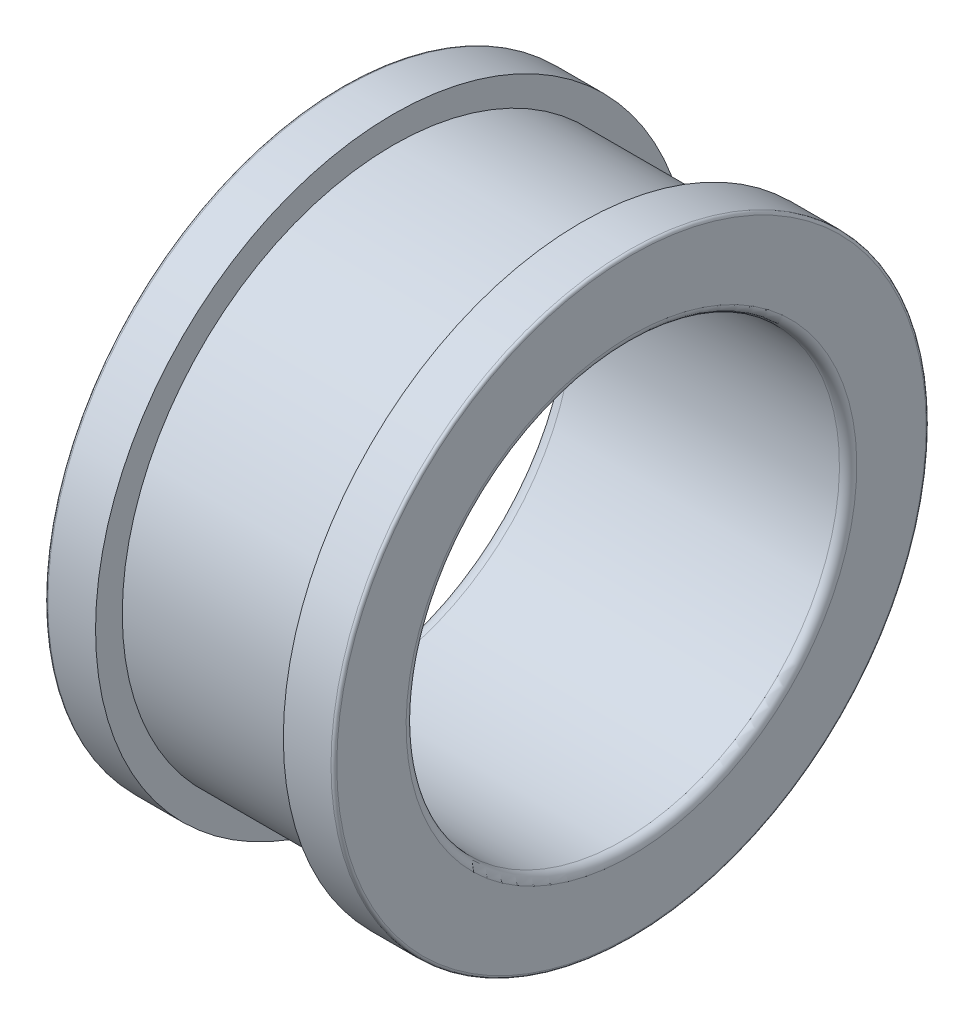
ISO-10303-21;
HEADER;
FILE_DESCRIPTION(('STEP AP214'),'2;1');
FILE_NAME('part.step','',(''),(''),'','','');
FILE_SCHEMA(('AUTOMOTIVE_DESIGN { 1 0 10303 214 1 1 1 1 }'));
ENDSEC;
DATA;
#1=APPLICATION_CONTEXT('core data for automotive mechanical design processes');
#2=APPLICATION_PROTOCOL_DEFINITION('international standard','automotive_design',2000,#1);
#3=PRODUCT_CONTEXT('',#1,'mechanical');
#4=PRODUCT('Part','Part','',(#3));
#5=PRODUCT_RELATED_PRODUCT_CATEGORY('part','',(#4));
#6=PRODUCT_DEFINITION_FORMATION('','',#4);
#7=PRODUCT_DEFINITION_CONTEXT('part definition',#1,'design');
#8=PRODUCT_DEFINITION('design','',#6,#7);
#9=PRODUCT_DEFINITION_SHAPE('','',#8);
#10=(LENGTH_UNIT() NAMED_UNIT(*) SI_UNIT(.MILLI.,.METRE.));
#11=(NAMED_UNIT(*) PLANE_ANGLE_UNIT() SI_UNIT($,.RADIAN.));
#12=(NAMED_UNIT(*) SI_UNIT($,.STERADIAN.) SOLID_ANGLE_UNIT());
#13=UNCERTAINTY_MEASURE_WITH_UNIT(LENGTH_MEASURE(1.E-05),#10,'distance_accuracy_value','');
#14=(GEOMETRIC_REPRESENTATION_CONTEXT(3) GLOBAL_UNCERTAINTY_ASSIGNED_CONTEXT((#13)) GLOBAL_UNIT_ASSIGNED_CONTEXT((#10,
#11,#12)) REPRESENTATION_CONTEXT('',''));
#15=CARTESIAN_POINT('',(0.,0.,0.));
#16=DIRECTION('',(0.,0.,1.));
#17=DIRECTION('',(1.,0.,0.));
#18=AXIS2_PLACEMENT_3D('',#15,#16,#17);
#19=CARTESIAN_POINT('',(18.15,0.,0.));
#20=DIRECTION('',(-1.,0.,0.));
#21=DIRECTION('',(0.,1.,0.));
#22=AXIS2_PLACEMENT_3D('',#19,#20,#21);
#23=CYLINDRICAL_SURFACE('',#22,20.6);
#24=CARTESIAN_POINT('',(16.5,0.,0.));
#25=DIRECTION('',(1.,0.,0.));
#26=DIRECTION('',(0.,1.,0.));
#27=AXIS2_PLACEMENT_3D('',#24,#25,#26);
#28=CIRCLE('',#27,20.6);
#29=CARTESIAN_POINT('',(16.5,20.6,0.));
#30=VERTEX_POINT('',#29);
#31=EDGE_CURVE('E11',#30,#30,#28,.T.);
#32=ORIENTED_EDGE('',*,*,#31,.T.);
#33=EDGE_LOOP('',(#32));
#34=FACE_BOUND('',#33,.T.);
#35=CARTESIAN_POINT('',(19.8,0.,0.));
#36=DIRECTION('',(1.,0.,0.));
#37=DIRECTION('',(0.,1.,0.));
#38=AXIS2_PLACEMENT_3D('',#35,#36,#37);
#39=CIRCLE('',#38,20.6);
#40=CARTESIAN_POINT('',(19.8,20.6,0.));
#41=VERTEX_POINT('',#40);
#42=EDGE_CURVE('E82',#41,#41,#39,.T.);
#43=ORIENTED_EDGE('',*,*,#42,.F.);
#44=EDGE_LOOP('',(#43));
#45=FACE_BOUND('',#44,.T.);
#46=ADVANCED_FACE('F17',(#34,#45),#23,.T.);
#47=CARTESIAN_POINT('',(16.5,19.675,0.));
#48=DIRECTION('',(-1.,0.,0.));
#49=DIRECTION('',(0.,-1.,0.));
#50=AXIS2_PLACEMENT_3D('',#47,#48,#49);
#51=PLANE('',#50);
#52=CARTESIAN_POINT('',(16.5,0.,0.));
#53=DIRECTION('',(1.,0.,0.));
#54=DIRECTION('',(0.,1.,0.));
#55=AXIS2_PLACEMENT_3D('',#52,#53,#54);
#56=CIRCLE('',#55,18.75);
#57=CARTESIAN_POINT('',(16.5,18.75,0.));
#58=VERTEX_POINT('',#57);
#59=EDGE_CURVE('E25',#58,#58,#56,.T.);
#60=ORIENTED_EDGE('',*,*,#59,.T.);
#61=EDGE_LOOP('',(#60));
#62=FACE_BOUND('',#61,.T.);
#63=ORIENTED_EDGE('',*,*,#31,.F.);
#64=EDGE_LOOP('',(#63));
#65=FACE_BOUND('',#64,.T.);
#66=ADVANCED_FACE('F109',(#62,#65),#51,.T.);
#67=CARTESIAN_POINT('',(10.,0.,0.));
#68=DIRECTION('',(-1.,0.,0.));
#69=DIRECTION('',(0.,1.,0.));
#70=AXIS2_PLACEMENT_3D('',#67,#68,#69);
#71=CYLINDRICAL_SURFACE('',#70,18.75);
#72=CARTESIAN_POINT('',(3.5,0.,0.));
#73=DIRECTION('',(1.,0.,0.));
#74=DIRECTION('',(0.,1.,0.));
#75=AXIS2_PLACEMENT_3D('',#72,#73,#74);
#76=CIRCLE('',#75,18.75);
#77=CARTESIAN_POINT('',(3.5,18.75,0.));
#78=VERTEX_POINT('',#77);
#79=EDGE_CURVE('E77',#78,#78,#76,.T.);
#80=ORIENTED_EDGE('',*,*,#79,.T.);
#81=EDGE_LOOP('',(#80));
#82=FACE_BOUND('',#81,.T.);
#83=ORIENTED_EDGE('',*,*,#59,.F.);
#84=EDGE_LOOP('',(#83));
#85=FACE_BOUND('',#84,.T.);
#86=ADVANCED_FACE('F113',(#82,#85),#71,.T.);
#87=CARTESIAN_POINT('',(3.5,19.675,0.));
#88=DIRECTION('',(1.,0.,0.));
#89=DIRECTION('',(0.,1.,0.));
#90=AXIS2_PLACEMENT_3D('',#87,#88,#89);
#91=PLANE('',#90);
#92=CARTESIAN_POINT('',(3.5,0.,0.));
#93=DIRECTION('',(1.,0.,0.));
#94=DIRECTION('',(0.,1.,0.));
#95=AXIS2_PLACEMENT_3D('',#92,#93,#94);
#96=CIRCLE('',#95,20.6);
#97=CARTESIAN_POINT('',(3.5,20.6,0.));
#98=VERTEX_POINT('',#97);
#99=EDGE_CURVE('E71',#98,#98,#96,.T.);
#100=ORIENTED_EDGE('',*,*,#99,.T.);
#101=EDGE_LOOP('',(#100));
#102=FACE_BOUND('',#101,.T.);
#103=ORIENTED_EDGE('',*,*,#79,.F.);
#104=EDGE_LOOP('',(#103));
#105=FACE_BOUND('',#104,.T.);
#106=ADVANCED_FACE('F141',(#102,#105),#91,.T.);
#107=CARTESIAN_POINT('',(1.85,0.,0.));
#108=DIRECTION('',(-1.,0.,0.));
#109=DIRECTION('',(0.,1.,0.));
#110=AXIS2_PLACEMENT_3D('',#107,#108,#109);
#111=CYLINDRICAL_SURFACE('',#110,20.6);
#112=CARTESIAN_POINT('',(0.2,0.,0.));
#113=DIRECTION('',(1.,0.,0.));
#114=DIRECTION('',(0.,1.,0.));
#115=AXIS2_PLACEMENT_3D('',#112,#113,#114);
#116=CIRCLE('',#115,20.6);
#117=CARTESIAN_POINT('',(0.2,20.6,0.));
#118=VERTEX_POINT('',#117);
#119=EDGE_CURVE('E69',#118,#118,#116,.T.);
#120=ORIENTED_EDGE('',*,*,#119,.T.);
#121=EDGE_LOOP('',(#120));
#122=FACE_BOUND('',#121,.T.);
#123=ORIENTED_EDGE('',*,*,#99,.F.);
#124=EDGE_LOOP('',(#123));
#125=FACE_BOUND('',#124,.T.);
#126=ADVANCED_FACE('F135',(#122,#125),#111,.T.);
#127=CARTESIAN_POINT('',(0.2,0.,0.));
#128=DIRECTION('',(1.,0.,0.));
#129=DIRECTION('',(0.,0.,-1.));
#130=AXIS2_PLACEMENT_3D('',#127,#128,#129);
#131=TOROIDAL_SURFACE('',#130,20.4,0.2);
#132=CARTESIAN_POINT('',(0.,0.,0.));
#133=DIRECTION('',(1.,0.,0.));
#134=DIRECTION('',(0.,1.,0.));
#135=AXIS2_PLACEMENT_3D('',#132,#133,#134);
#136=CIRCLE('',#135,20.4);
#137=CARTESIAN_POINT('',(0.,20.4,0.));
#138=VERTEX_POINT('',#137);
#139=EDGE_CURVE('E65',#138,#138,#136,.T.);
#140=ORIENTED_EDGE('',*,*,#139,.T.);
#141=EDGE_LOOP('',(#140));
#142=FACE_BOUND('',#141,.T.);
#143=ORIENTED_EDGE('',*,*,#119,.F.);
#144=EDGE_LOOP('',(#143));
#145=FACE_BOUND('',#144,.T.);
#146=ADVANCED_FACE('F66',(#142,#145),#131,.T.);
#147=CARTESIAN_POINT('',(0.,18.2,0.));
#148=DIRECTION('',(-1.,0.,0.));
#149=DIRECTION('',(0.,-1.,0.));
#150=AXIS2_PLACEMENT_3D('',#147,#148,#149);
#151=PLANE('',#150);
#152=CARTESIAN_POINT('',(0.,0.,0.));
#153=DIRECTION('',(1.,0.,0.));
#154=DIRECTION('',(0.,1.,0.));
#155=AXIS2_PLACEMENT_3D('',#152,#153,#154);
#156=CIRCLE('',#155,16.);
#157=CARTESIAN_POINT('',(0.,16.,0.));
#158=VERTEX_POINT('',#157);
#159=EDGE_CURVE('E70',#158,#158,#156,.T.);
#160=ORIENTED_EDGE('',*,*,#159,.T.);
#161=EDGE_LOOP('',(#160));
#162=FACE_BOUND('',#161,.T.);
#163=ORIENTED_EDGE('',*,*,#139,.F.);
#164=EDGE_LOOP('',(#163));
#165=FACE_BOUND('',#164,.T.);
#166=ADVANCED_FACE('F127',(#162,#165),#151,.T.);
#167=CARTESIAN_POINT('',(1.,0.,0.));
#168=DIRECTION('',(1.,0.,0.));
#169=DIRECTION('',(0.,0.,-1.));
#170=AXIS2_PLACEMENT_3D('',#167,#168,#169);
#171=TOROIDAL_SURFACE('',#170,16.,1.);
#172=CARTESIAN_POINT('',(1.,0.,0.));
#173=DIRECTION('',(1.,0.,0.));
#174=DIRECTION('',(0.,1.,0.));
#175=AXIS2_PLACEMENT_3D('',#172,#173,#174);
#176=CIRCLE('',#175,15.);
#177=CARTESIAN_POINT('',(1.,15.,0.));
#178=VERTEX_POINT('',#177);
#179=EDGE_CURVE('E73',#178,#178,#176,.T.);
#180=ORIENTED_EDGE('',*,*,#179,.T.);
#181=EDGE_LOOP('',(#180));
#182=FACE_BOUND('',#181,.T.);
#183=ORIENTED_EDGE('',*,*,#159,.F.);
#184=EDGE_LOOP('',(#183));
#185=FACE_BOUND('',#184,.T.);
#186=ADVANCED_FACE('F105',(#182,#185),#171,.T.);
#187=CARTESIAN_POINT('',(10.2,0.,0.));
#188=DIRECTION('',(-1.,0.,0.));
#189=DIRECTION('',(0.,1.,0.));
#190=AXIS2_PLACEMENT_3D('',#187,#188,#189);
#191=CYLINDRICAL_SURFACE('',#190,15.);
#192=CARTESIAN_POINT('',(19.4,0.,0.));
#193=DIRECTION('',(1.,0.,0.));
#194=DIRECTION('',(0.,1.,0.));
#195=AXIS2_PLACEMENT_3D('',#192,#193,#194);
#196=CIRCLE('',#195,15.);
#197=CARTESIAN_POINT('',(19.4,15.,0.));
#198=VERTEX_POINT('',#197);
#199=EDGE_CURVE('E20',#198,#198,#196,.T.);
#200=ORIENTED_EDGE('',*,*,#199,.T.);
#201=EDGE_LOOP('',(#200));
#202=FACE_BOUND('',#201,.T.);
#203=ORIENTED_EDGE('',*,*,#179,.F.);
#204=EDGE_LOOP('',(#203));
#205=FACE_BOUND('',#204,.T.);
#206=ADVANCED_FACE('F90',(#202,#205),#191,.F.);
#207=CARTESIAN_POINT('',(19.4,0.,0.));
#208=DIRECTION('',(1.,0.,0.));
#209=DIRECTION('',(0.,0.,-1.));
#210=AXIS2_PLACEMENT_3D('',#207,#208,#209);
#211=TOROIDAL_SURFACE('',#210,15.6,0.6);
#212=CARTESIAN_POINT('',(20.,0.,0.));
#213=DIRECTION('',(1.,0.,0.));
#214=DIRECTION('',(0.,1.,0.));
#215=AXIS2_PLACEMENT_3D('',#212,#213,#214);
#216=CIRCLE('',#215,15.6);
#217=CARTESIAN_POINT('',(20.,15.6,0.));
#218=VERTEX_POINT('',#217);
#219=EDGE_CURVE('E84',#218,#218,#216,.T.);
#220=ORIENTED_EDGE('',*,*,#219,.T.);
#221=EDGE_LOOP('',(#220));
#222=FACE_BOUND('',#221,.T.);
#223=ORIENTED_EDGE('',*,*,#199,.F.);
#224=EDGE_LOOP('',(#223));
#225=FACE_BOUND('',#224,.T.);
#226=ADVANCED_FACE('F93',(#222,#225),#211,.T.);
#227=CARTESIAN_POINT('',(20.,18.,0.));
#228=DIRECTION('',(1.,0.,0.));
#229=DIRECTION('',(0.,1.,0.));
#230=AXIS2_PLACEMENT_3D('',#227,#228,#229);
#231=PLANE('',#230);
#232=CARTESIAN_POINT('',(20.,0.,0.));
#233=DIRECTION('',(1.,0.,0.));
#234=DIRECTION('',(0.,1.,0.));
#235=AXIS2_PLACEMENT_3D('',#232,#233,#234);
#236=CIRCLE('',#235,20.4);
#237=CARTESIAN_POINT('',(20.,20.4,0.));
#238=VERTEX_POINT('',#237);
#239=EDGE_CURVE('E80',#238,#238,#236,.T.);
#240=ORIENTED_EDGE('',*,*,#239,.T.);
#241=EDGE_LOOP('',(#240));
#242=FACE_BOUND('',#241,.T.);
#243=ORIENTED_EDGE('',*,*,#219,.F.);
#244=EDGE_LOOP('',(#243));
#245=FACE_BOUND('',#244,.T.);
#246=ADVANCED_FACE('F95',(#242,#245),#231,.T.);
#247=CARTESIAN_POINT('',(19.8,0.,0.));
#248=DIRECTION('',(1.,0.,0.));
#249=DIRECTION('',(0.,0.,-1.));
#250=AXIS2_PLACEMENT_3D('',#247,#248,#249);
#251=TOROIDAL_SURFACE('',#250,20.4,0.2);
#252=ORIENTED_EDGE('',*,*,#42,.T.);
#253=EDGE_LOOP('',(#252));
#254=FACE_BOUND('',#253,.T.);
#255=ORIENTED_EDGE('',*,*,#239,.F.);
#256=EDGE_LOOP('',(#255));
#257=FACE_BOUND('',#256,.T.);
#258=ADVANCED_FACE('F102',(#254,#257),#251,.T.);
#259=CLOSED_SHELL('',(#46,#66,#86,#106,#126,#146,#166,#186,#206,#226,#246,#258));
#260=MANIFOLD_SOLID_BREP('B1',#259);
#261=ADVANCED_BREP_SHAPE_REPRESENTATION('',(#18,#260),#14);
#262=SHAPE_DEFINITION_REPRESENTATION(#9,#261);
ENDSEC;
END-ISO-10303-21;
